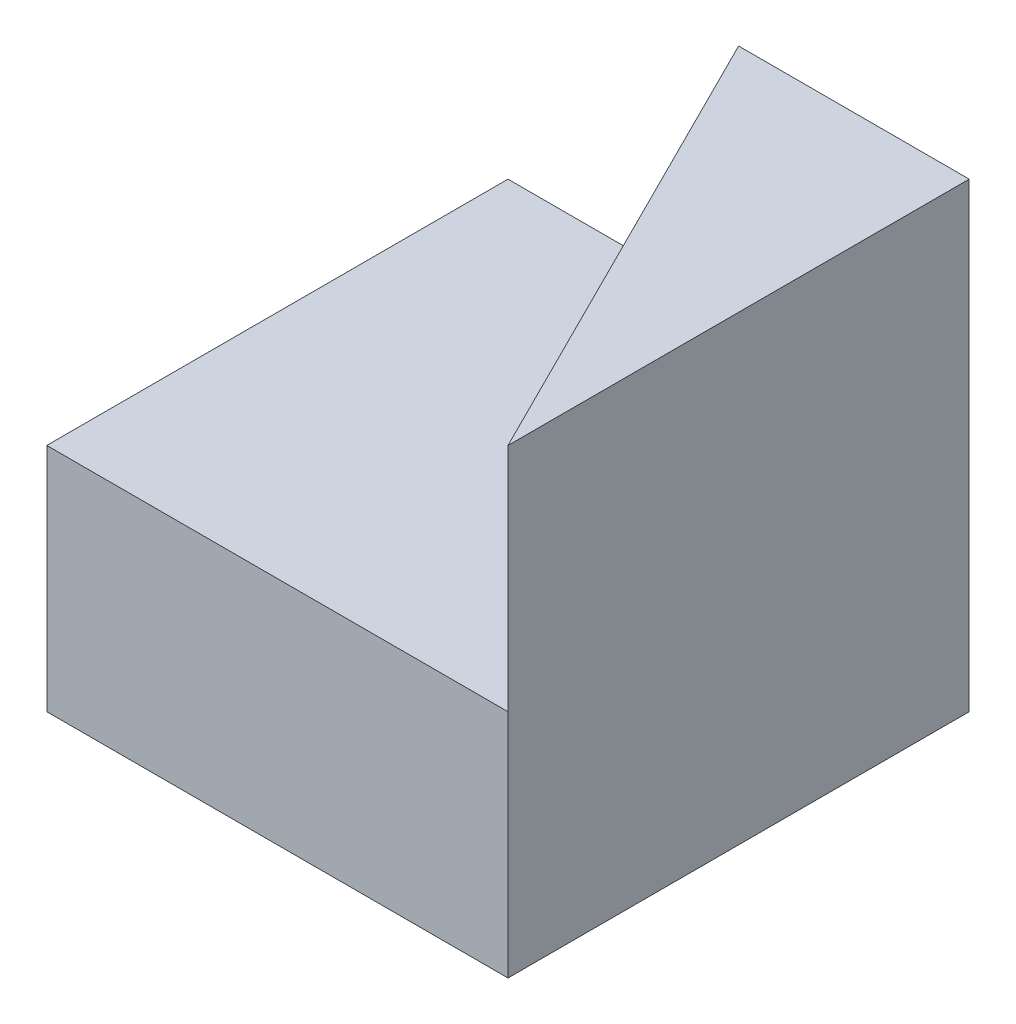
ISO-10303-21;
HEADER;
FILE_DESCRIPTION(('STEP AP214'),'2;1');
FILE_NAME('part.step','',(''),(''),'','','');
FILE_SCHEMA(('AUTOMOTIVE_DESIGN { 1 0 10303 214 1 1 1 1 }'));
ENDSEC;
DATA;
#1=APPLICATION_CONTEXT('core data for automotive mechanical design processes');
#2=APPLICATION_PROTOCOL_DEFINITION('international standard','automotive_design',2000,#1);
#3=PRODUCT_CONTEXT('',#1,'mechanical');
#4=PRODUCT('Part','Part','',(#3));
#5=PRODUCT_RELATED_PRODUCT_CATEGORY('part','',(#4));
#6=PRODUCT_DEFINITION_FORMATION('','',#4);
#7=PRODUCT_DEFINITION_CONTEXT('part definition',#1,'design');
#8=PRODUCT_DEFINITION('design','',#6,#7);
#9=PRODUCT_DEFINITION_SHAPE('','',#8);
#10=(LENGTH_UNIT() NAMED_UNIT(*) SI_UNIT(.MILLI.,.METRE.));
#11=(NAMED_UNIT(*) PLANE_ANGLE_UNIT() SI_UNIT($,.RADIAN.));
#12=(NAMED_UNIT(*) SI_UNIT($,.STERADIAN.) SOLID_ANGLE_UNIT());
#13=UNCERTAINTY_MEASURE_WITH_UNIT(LENGTH_MEASURE(1.E-05),#10,'distance_accuracy_value','');
#14=(GEOMETRIC_REPRESENTATION_CONTEXT(3) GLOBAL_UNCERTAINTY_ASSIGNED_CONTEXT((#13)) GLOBAL_UNIT_ASSIGNED_CONTEXT((#10,
#11,#12)) REPRESENTATION_CONTEXT('',''));
#15=CARTESIAN_POINT('',(0.,0.,0.));
#16=DIRECTION('',(0.,0.,1.));
#17=DIRECTION('',(1.,0.,0.));
#18=AXIS2_PLACEMENT_3D('',#15,#16,#17);
#19=CARTESIAN_POINT('',(0.,0.,40.));
#20=DIRECTION('',(0.,0.,-1.));
#21=DIRECTION('',(-1.,0.,0.));
#22=AXIS2_PLACEMENT_3D('',#19,#20,#21);
#23=PLANE('',#22);
#24=DIRECTION('',(0.,1.,0.));
#25=VECTOR('',#24,1.);
#26=CARTESIAN_POINT('',(40.,0.,40.));
#27=LINE('',#26,#25);
#28=CARTESIAN_POINT('',(40.,0.,40.));
#29=VERTEX_POINT('',#28);
#30=CARTESIAN_POINT('',(40.,20.,40.));
#31=VERTEX_POINT('',#30);
#32=EDGE_CURVE('E106',#29,#31,#27,.T.);
#33=ORIENTED_EDGE('',*,*,#32,.T.);
#34=DIRECTION('',(1.,0.,0.));
#35=VECTOR('',#34,1.);
#36=CARTESIAN_POINT('',(20.,20.,40.));
#37=LINE('',#36,#35);
#38=CARTESIAN_POINT('',(0.,20.,40.));
#39=VERTEX_POINT('',#38);
#40=EDGE_CURVE('E81',#39,#31,#37,.T.);
#41=ORIENTED_EDGE('',*,*,#40,.F.);
#42=DIRECTION('',(0.,-1.,0.));
#43=VECTOR('',#42,1.);
#44=CARTESIAN_POINT('',(0.,0.,40.));
#45=LINE('',#44,#43);
#46=CARTESIAN_POINT('',(0.,0.,40.));
#47=VERTEX_POINT('',#46);
#48=EDGE_CURVE('E111',#39,#47,#45,.T.);
#49=ORIENTED_EDGE('',*,*,#48,.T.);
#50=DIRECTION('',(1.,0.,0.));
#51=VECTOR('',#50,1.);
#52=CARTESIAN_POINT('',(0.,0.,40.));
#53=LINE('',#52,#51);
#54=EDGE_CURVE('E50',#47,#29,#53,.T.);
#55=ORIENTED_EDGE('',*,*,#54,.T.);
#56=EDGE_LOOP('',(#33,#41,#49,#55));
#57=FACE_BOUND('',#56,.T.);
#58=ADVANCED_FACE('F35',(#57),#23,.F.);
#59=CARTESIAN_POINT('',(0.,40.,0.));
#60=DIRECTION('',(0.,1.,0.));
#61=DIRECTION('',(0.,0.,1.));
#62=AXIS2_PLACEMENT_3D('',#59,#60,#61);
#63=PLANE('',#62);
#64=DIRECTION('',(-1.,0.,0.));
#65=VECTOR('',#64,1.);
#66=CARTESIAN_POINT('',(20.,40.,0.));
#67=LINE('',#66,#65);
#68=CARTESIAN_POINT('',(40.,40.,0.));
#69=VERTEX_POINT('',#68);
#70=CARTESIAN_POINT('',(20.,40.,0.));
#71=VERTEX_POINT('',#70);
#72=EDGE_CURVE('E89',#69,#71,#67,.T.);
#73=ORIENTED_EDGE('',*,*,#72,.T.);
#74=DIRECTION('',(0.447213595499958,0.,0.894427190999916));
#75=VECTOR('',#74,1.);
#76=CARTESIAN_POINT('',(16.,40.,-8.));
#77=LINE('',#76,#75);
#78=CARTESIAN_POINT('',(40.,40.,40.));
#79=VERTEX_POINT('',#78);
#80=EDGE_CURVE('E99',#71,#79,#77,.T.);
#81=ORIENTED_EDGE('',*,*,#80,.T.);
#82=DIRECTION('',(0.,0.,-1.));
#83=VECTOR('',#82,1.);
#84=CARTESIAN_POINT('',(40.,40.,40.));
#85=LINE('',#84,#83);
#86=EDGE_CURVE('E108',#79,#69,#85,.T.);
#87=ORIENTED_EDGE('',*,*,#86,.T.);
#88=EDGE_LOOP('',(#73,#81,#87));
#89=FACE_BOUND('',#88,.T.);
#90=ADVANCED_FACE('F131',(#89),#63,.T.);
#91=CARTESIAN_POINT('',(0.,0.,40.));
#92=DIRECTION('',(0.,1.,0.));
#93=DIRECTION('',(0.,0.,1.));
#94=AXIS2_PLACEMENT_3D('',#91,#92,#93);
#95=PLANE('',#94);
#96=ORIENTED_EDGE('',*,*,#54,.F.);
#97=DIRECTION('',(0.,0.,1.));
#98=VECTOR('',#97,1.);
#99=CARTESIAN_POINT('',(0.,0.,0.));
#100=LINE('',#99,#98);
#101=CARTESIAN_POINT('',(0.,0.,0.));
#102=VERTEX_POINT('',#101);
#103=EDGE_CURVE('E123',#102,#47,#100,.T.);
#104=ORIENTED_EDGE('',*,*,#103,.F.);
#105=DIRECTION('',(1.,0.,0.));
#106=VECTOR('',#105,1.);
#107=CARTESIAN_POINT('',(0.,0.,0.));
#108=LINE('',#107,#106);
#109=CARTESIAN_POINT('',(40.,0.,0.));
#110=VERTEX_POINT('',#109);
#111=EDGE_CURVE('E115',#102,#110,#108,.T.);
#112=ORIENTED_EDGE('',*,*,#111,.T.);
#113=DIRECTION('',(0.,0.,-1.));
#114=VECTOR('',#113,1.);
#115=CARTESIAN_POINT('',(40.,0.,40.));
#116=LINE('',#115,#114);
#117=EDGE_CURVE('E44',#29,#110,#116,.T.);
#118=ORIENTED_EDGE('',*,*,#117,.F.);
#119=EDGE_LOOP('',(#96,#104,#112,#118));
#120=FACE_BOUND('',#119,.T.);
#121=ADVANCED_FACE('F37',(#120),#95,.F.);
#122=CARTESIAN_POINT('',(40.,0.,40.));
#123=DIRECTION('',(-1.,0.,0.));
#124=DIRECTION('',(0.,0.,1.));
#125=AXIS2_PLACEMENT_3D('',#122,#123,#124);
#126=PLANE('',#125);
#127=DIRECTION('',(0.,1.,0.));
#128=VECTOR('',#127,1.);
#129=CARTESIAN_POINT('',(40.,0.,0.));
#130=LINE('',#129,#128);
#131=EDGE_CURVE('E117',#110,#69,#130,.T.);
#132=ORIENTED_EDGE('',*,*,#131,.T.);
#133=ORIENTED_EDGE('',*,*,#86,.F.);
#134=DIRECTION('',(0.,1.,0.));
#135=VECTOR('',#134,1.);
#136=CARTESIAN_POINT('',(40.,20.,40.));
#137=LINE('',#136,#135);
#138=EDGE_CURVE('E95',#31,#79,#137,.T.);
#139=ORIENTED_EDGE('',*,*,#138,.F.);
#140=ORIENTED_EDGE('',*,*,#32,.F.);
#141=ORIENTED_EDGE('',*,*,#117,.T.);
#142=EDGE_LOOP('',(#132,#133,#139,#140,#141));
#143=FACE_BOUND('',#142,.T.);
#144=ADVANCED_FACE('F104',(#143),#126,.F.);
#145=CARTESIAN_POINT('',(0.,0.,0.));
#146=DIRECTION('',(0.,0.,-1.));
#147=DIRECTION('',(-1.,0.,0.));
#148=AXIS2_PLACEMENT_3D('',#145,#146,#147);
#149=PLANE('',#148);
#150=DIRECTION('',(0.,-1.,0.));
#151=VECTOR('',#150,1.);
#152=CARTESIAN_POINT('',(20.,0.,0.));
#153=LINE('',#152,#151);
#154=CARTESIAN_POINT('',(20.0000000000001,20.,-2.4980018054066E-13));
#155=VERTEX_POINT('',#154);
#156=EDGE_CURVE('E11',#71,#155,#153,.T.);
#157=ORIENTED_EDGE('',*,*,#156,.F.);
#158=ORIENTED_EDGE('',*,*,#72,.F.);
#159=ORIENTED_EDGE('',*,*,#131,.F.);
#160=ORIENTED_EDGE('',*,*,#111,.F.);
#161=DIRECTION('',(0.,1.,0.));
#162=VECTOR('',#161,1.);
#163=CARTESIAN_POINT('',(0.,0.,0.));
#164=LINE('',#163,#162);
#165=CARTESIAN_POINT('',(0.,20.,0.));
#166=VERTEX_POINT('',#165);
#167=EDGE_CURVE('E90',#102,#166,#164,.T.);
#168=ORIENTED_EDGE('',*,*,#167,.T.);
#169=DIRECTION('',(-1.,0.,0.));
#170=VECTOR('',#169,1.);
#171=CARTESIAN_POINT('',(0.,20.,0.));
#172=LINE('',#171,#170);
#173=EDGE_CURVE('E125',#155,#166,#172,.T.);
#174=ORIENTED_EDGE('',*,*,#173,.F.);
#175=EDGE_LOOP('',(#157,#158,#159,#160,#168,#174));
#176=FACE_BOUND('',#175,.T.);
#177=ADVANCED_FACE('F134',(#176),#149,.T.);
#178=CARTESIAN_POINT('',(20.,20.,-69.));
#179=DIRECTION('',(0.,-1.,0.));
#180=DIRECTION('',(0.,0.,-1.));
#181=AXIS2_PLACEMENT_3D('',#178,#179,#180);
#182=PLANE('',#181);
#183=ORIENTED_EDGE('',*,*,#40,.T.);
#184=DIRECTION('',(0.447213595499958,0.,0.894427190999916));
#185=VECTOR('',#184,1.);
#186=CARTESIAN_POINT('',(16.,20.,-8.));
#187=LINE('',#186,#185);
#188=EDGE_CURVE('E85',#155,#31,#187,.T.);
#189=ORIENTED_EDGE('',*,*,#188,.F.);
#190=ORIENTED_EDGE('',*,*,#173,.T.);
#191=DIRECTION('',(0.,0.,1.));
#192=VECTOR('',#191,1.);
#193=CARTESIAN_POINT('',(0.,20.,0.));
#194=LINE('',#193,#192);
#195=EDGE_CURVE('E87',#166,#39,#194,.T.);
#196=ORIENTED_EDGE('',*,*,#195,.T.);
#197=EDGE_LOOP('',(#183,#189,#190,#196));
#198=FACE_BOUND('',#197,.T.);
#199=ADVANCED_FACE('F83',(#198),#182,.F.);
#200=CARTESIAN_POINT('',(0.,0.,0.));
#201=DIRECTION('',(-1.,0.,0.));
#202=DIRECTION('',(0.,0.,1.));
#203=AXIS2_PLACEMENT_3D('',#200,#201,#202);
#204=PLANE('',#203);
#205=ORIENTED_EDGE('',*,*,#195,.F.);
#206=ORIENTED_EDGE('',*,*,#167,.F.);
#207=ORIENTED_EDGE('',*,*,#103,.T.);
#208=ORIENTED_EDGE('',*,*,#48,.F.);
#209=EDGE_LOOP('',(#205,#206,#207,#208));
#210=FACE_BOUND('',#209,.T.);
#211=ADVANCED_FACE('F138',(#210),#204,.T.);
#212=CARTESIAN_POINT('',(16.,20.,-8.));
#213=DIRECTION('',(-0.894427190999916,0.,0.447213595499958));
#214=DIRECTION('',(0.447213595499958,0.,0.894427190999916));
#215=AXIS2_PLACEMENT_3D('',#212,#213,#214);
#216=PLANE('',#215);
#217=ORIENTED_EDGE('',*,*,#80,.F.);
#218=ORIENTED_EDGE('',*,*,#156,.T.);
#219=ORIENTED_EDGE('',*,*,#188,.T.);
#220=ORIENTED_EDGE('',*,*,#138,.T.);
#221=EDGE_LOOP('',(#217,#218,#219,#220));
#222=FACE_BOUND('',#221,.T.);
#223=ADVANCED_FACE('F94',(#222),#216,.T.);
#224=CLOSED_SHELL('',(#58,#90,#121,#144,#177,#199,#211,#223));
#225=MANIFOLD_SOLID_BREP('B2',#224);
#226=ADVANCED_BREP_SHAPE_REPRESENTATION('',(#18,#225),#14);
#227=SHAPE_DEFINITION_REPRESENTATION(#9,#226);
ENDSEC;
END-ISO-10303-21;
